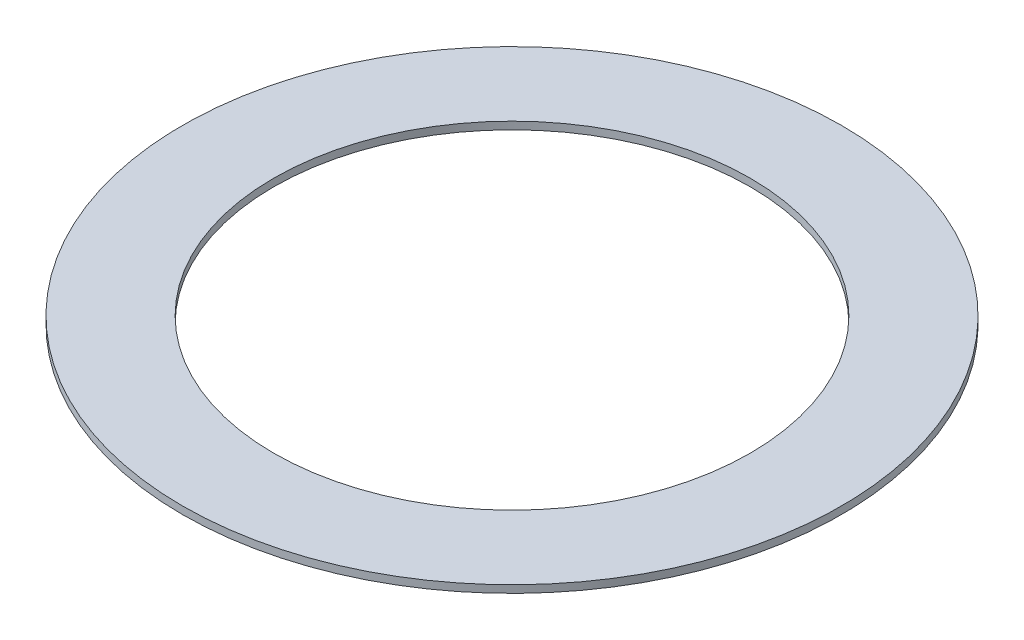
ISO-10303-21;
HEADER;
FILE_DESCRIPTION(('STEP AP214'),'2;1');
FILE_NAME('part.step','',(''),(''),'','','');
FILE_SCHEMA(('AUTOMOTIVE_DESIGN { 1 0 10303 214 1 1 1 1 }'));
ENDSEC;
DATA;
#1=APPLICATION_CONTEXT('core data for automotive mechanical design processes');
#2=APPLICATION_PROTOCOL_DEFINITION('international standard','automotive_design',2000,#1);
#3=PRODUCT_CONTEXT('',#1,'mechanical');
#4=PRODUCT('Part','Part','',(#3));
#5=PRODUCT_RELATED_PRODUCT_CATEGORY('part','',(#4));
#6=PRODUCT_DEFINITION_FORMATION('','',#4);
#7=PRODUCT_DEFINITION_CONTEXT('part definition',#1,'design');
#8=PRODUCT_DEFINITION('design','',#6,#7);
#9=PRODUCT_DEFINITION_SHAPE('','',#8);
#10=(LENGTH_UNIT() NAMED_UNIT(*) SI_UNIT(.MILLI.,.METRE.));
#11=(NAMED_UNIT(*) PLANE_ANGLE_UNIT() SI_UNIT($,.RADIAN.));
#12=(NAMED_UNIT(*) SI_UNIT($,.STERADIAN.) SOLID_ANGLE_UNIT());
#13=UNCERTAINTY_MEASURE_WITH_UNIT(LENGTH_MEASURE(1.E-05),#10,'distance_accuracy_value','');
#14=(GEOMETRIC_REPRESENTATION_CONTEXT(3) GLOBAL_UNCERTAINTY_ASSIGNED_CONTEXT((#13)) GLOBAL_UNIT_ASSIGNED_CONTEXT((#10,
#11,#12)) REPRESENTATION_CONTEXT('',''));
#15=CARTESIAN_POINT('',(0.,0.,0.));
#16=DIRECTION('',(0.,0.,1.));
#17=DIRECTION('',(1.,0.,0.));
#18=AXIS2_PLACEMENT_3D('',#15,#16,#17);
#19=CARTESIAN_POINT('',(0.,2.4,0.));
#20=DIRECTION('',(0.,1.,0.));
#21=DIRECTION('',(0.,0.,1.));
#22=AXIS2_PLACEMENT_3D('',#19,#20,#21);
#23=PLANE('',#22);
#24=CARTESIAN_POINT('',(0.,2.4,0.));
#25=DIRECTION('',(0.,1.,0.));
#26=DIRECTION('',(0.,0.,1.));
#27=AXIS2_PLACEMENT_3D('',#24,#25,#26);
#28=CIRCLE('',#27,105.41);
#29=CARTESIAN_POINT('',(0.,2.4,105.41));
#30=VERTEX_POINT('',#29);
#31=EDGE_CURVE('E10',#30,#30,#28,.T.);
#32=ORIENTED_EDGE('',*,*,#31,.T.);
#33=EDGE_LOOP('',(#32));
#34=FACE_BOUND('',#33,.T.);
#35=CARTESIAN_POINT('',(0.,2.4,0.));
#36=DIRECTION('',(0.,1.,0.));
#37=DIRECTION('',(0.,0.,1.));
#38=AXIS2_PLACEMENT_3D('',#35,#36,#37);
#39=CIRCLE('',#38,76.2);
#40=CARTESIAN_POINT('',(0.,2.4,76.2));
#41=VERTEX_POINT('',#40);
#42=EDGE_CURVE('E43',#41,#41,#39,.T.);
#43=ORIENTED_EDGE('',*,*,#42,.F.);
#44=EDGE_LOOP('',(#43));
#45=FACE_BOUND('',#44,.T.);
#46=ADVANCED_FACE('F32',(#34,#45),#23,.T.);
#47=CARTESIAN_POINT('',(0.,0.,0.));
#48=DIRECTION('',(0.,1.,0.));
#49=DIRECTION('',(0.,0.,1.));
#50=AXIS2_PLACEMENT_3D('',#47,#48,#49);
#51=PLANE('',#50);
#52=CARTESIAN_POINT('',(0.,0.,0.));
#53=DIRECTION('',(0.,1.,0.));
#54=DIRECTION('',(0.,0.,1.));
#55=AXIS2_PLACEMENT_3D('',#52,#53,#54);
#56=CIRCLE('',#55,105.41);
#57=CARTESIAN_POINT('',(0.,0.,105.41));
#58=VERTEX_POINT('',#57);
#59=EDGE_CURVE('E36',#58,#58,#56,.T.);
#60=ORIENTED_EDGE('',*,*,#59,.F.);
#61=EDGE_LOOP('',(#60));
#62=FACE_BOUND('',#61,.T.);
#63=CARTESIAN_POINT('',(0.,0.,0.));
#64=DIRECTION('',(0.,1.,0.));
#65=DIRECTION('',(0.,0.,1.));
#66=AXIS2_PLACEMENT_3D('',#63,#64,#65);
#67=CIRCLE('',#66,76.2);
#68=CARTESIAN_POINT('',(0.,0.,76.2));
#69=VERTEX_POINT('',#68);
#70=EDGE_CURVE('E45',#69,#69,#67,.T.);
#71=ORIENTED_EDGE('',*,*,#70,.T.);
#72=EDGE_LOOP('',(#71));
#73=FACE_BOUND('',#72,.T.);
#74=ADVANCED_FACE('F55',(#62,#73),#51,.F.);
#75=CARTESIAN_POINT('',(0.,2.4,0.));
#76=DIRECTION('',(0.,-1.,0.));
#77=DIRECTION('',(0.,0.,-1.));
#78=AXIS2_PLACEMENT_3D('',#75,#76,#77);
#79=CYLINDRICAL_SURFACE('',#78,105.41);
#80=ORIENTED_EDGE('',*,*,#31,.F.);
#81=EDGE_LOOP('',(#80));
#82=FACE_BOUND('',#81,.T.);
#83=ORIENTED_EDGE('',*,*,#59,.T.);
#84=EDGE_LOOP('',(#83));
#85=FACE_BOUND('',#84,.T.);
#86=ADVANCED_FACE('F34',(#82,#85),#79,.T.);
#87=CARTESIAN_POINT('',(0.,2.4,0.));
#88=DIRECTION('',(0.,-1.,0.));
#89=DIRECTION('',(0.,0.,-1.));
#90=AXIS2_PLACEMENT_3D('',#87,#88,#89);
#91=CYLINDRICAL_SURFACE('',#90,76.2);
#92=ORIENTED_EDGE('',*,*,#42,.T.);
#93=EDGE_LOOP('',(#92));
#94=FACE_BOUND('',#93,.T.);
#95=ORIENTED_EDGE('',*,*,#70,.F.);
#96=EDGE_LOOP('',(#95));
#97=FACE_BOUND('',#96,.T.);
#98=ADVANCED_FACE('F51',(#94,#97),#91,.F.);
#99=CLOSED_SHELL('',(#46,#74,#86,#98));
#100=MANIFOLD_SOLID_BREP('B2',#99);
#101=ADVANCED_BREP_SHAPE_REPRESENTATION('',(#18,#100),#14);
#102=SHAPE_DEFINITION_REPRESENTATION(#9,#101);
ENDSEC;
END-ISO-10303-21;
